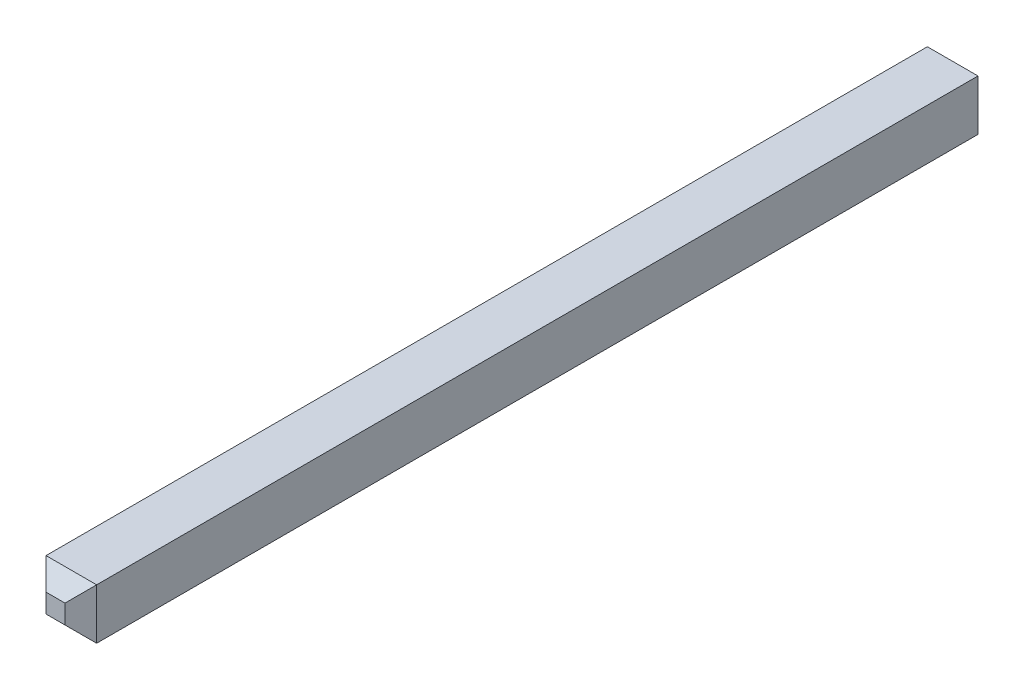
ISO-10303-21;
HEADER;
FILE_DESCRIPTION(('STEP AP214'),'2;1');
FILE_NAME('part.step','',(''),(''),'','','');
FILE_SCHEMA(('AUTOMOTIVE_DESIGN { 1 0 10303 214 1 1 1 1 }'));
ENDSEC;
DATA;
#1=APPLICATION_CONTEXT('core data for automotive mechanical design processes');
#2=APPLICATION_PROTOCOL_DEFINITION('international standard','automotive_design',2000,#1);
#3=PRODUCT_CONTEXT('',#1,'mechanical');
#4=PRODUCT('Part','Part','',(#3));
#5=PRODUCT_RELATED_PRODUCT_CATEGORY('part','',(#4));
#6=PRODUCT_DEFINITION_FORMATION('','',#4);
#7=PRODUCT_DEFINITION_CONTEXT('part definition',#1,'design');
#8=PRODUCT_DEFINITION('design','',#6,#7);
#9=PRODUCT_DEFINITION_SHAPE('','',#8);
#10=(LENGTH_UNIT() NAMED_UNIT(*) SI_UNIT(.MILLI.,.METRE.));
#11=(NAMED_UNIT(*) PLANE_ANGLE_UNIT() SI_UNIT($,.RADIAN.));
#12=(NAMED_UNIT(*) SI_UNIT($,.STERADIAN.) SOLID_ANGLE_UNIT());
#13=UNCERTAINTY_MEASURE_WITH_UNIT(LENGTH_MEASURE(1.E-05),#10,'distance_accuracy_value','');
#14=(GEOMETRIC_REPRESENTATION_CONTEXT(3) GLOBAL_UNCERTAINTY_ASSIGNED_CONTEXT((#13)) GLOBAL_UNIT_ASSIGNED_CONTEXT((#10,
#11,#12)) REPRESENTATION_CONTEXT('',''));
#15=CARTESIAN_POINT('',(0.,0.,0.));
#16=DIRECTION('',(0.,0.,1.));
#17=DIRECTION('',(1.,0.,0.));
#18=AXIS2_PLACEMENT_3D('',#15,#16,#17);
#19=CARTESIAN_POINT('',(0.32384,0.12,-5.77));
#20=DIRECTION('',(0.,0.707106781186567,-0.707106781186528));
#21=DIRECTION('',(-1.,0.,0.));
#22=AXIS2_PLACEMENT_3D('',#19,#20,#21);
#23=PLANE('',#22);
#24=DIRECTION('',(0.57735026918962,-0.577350269189635,-0.577350269189622));
#25=VECTOR('',#24,1.);
#26=CARTESIAN_POINT('',(-0.31999999999999,0.320000000000007,-5.57));
#27=LINE('',#26,#25);
#28=CARTESIAN_POINT('',(-0.31999999999999,0.320000000000004,-5.57));
#29=VERTEX_POINT('',#28);
#30=CARTESIAN_POINT('',(-0.11999999999999,0.120000000000001,-5.77));
#31=VERTEX_POINT('',#30);
#32=EDGE_CURVE('E20',#29,#31,#27,.T.);
#33=ORIENTED_EDGE('',*,*,#32,.F.);
#34=DIRECTION('',(-1.,0.,0.));
#35=VECTOR('',#34,1.);
#36=CARTESIAN_POINT('',(0.,0.32,-5.57));
#37=LINE('',#36,#35);
#38=CARTESIAN_POINT('',(0.32,0.32,-5.57));
#39=VERTEX_POINT('',#38);
#40=EDGE_CURVE('E78',#39,#29,#37,.T.);
#41=ORIENTED_EDGE('',*,*,#40,.F.);
#42=DIRECTION('',(0.577350269189627,0.577350269189623,0.577350269189628));
#43=VECTOR('',#42,1.);
#44=CARTESIAN_POINT('',(0.12,0.120000000000002,-5.77));
#45=LINE('',#44,#43);
#46=CARTESIAN_POINT('',(0.12,0.120000000000001,-5.77));
#47=VERTEX_POINT('',#46);
#48=EDGE_CURVE('E115',#47,#39,#45,.T.);
#49=ORIENTED_EDGE('',*,*,#48,.F.);
#50=DIRECTION('',(1.,0.,0.));
#51=VECTOR('',#50,1.);
#52=CARTESIAN_POINT('',(0.,0.12,-5.77));
#53=LINE('',#52,#51);
#54=EDGE_CURVE('E81',#31,#47,#53,.T.);
#55=ORIENTED_EDGE('',*,*,#54,.F.);
#56=EDGE_LOOP('',(#33,#41,#49,#55));
#57=FACE_BOUND('',#56,.T.);
#58=ADVANCED_FACE('F16',(#57),#23,.T.);
#59=CARTESIAN_POINT('',(-0.11999999999999,0.32384,-5.77));
#60=DIRECTION('',(-0.707106781186548,0.,-0.707106781186547));
#61=DIRECTION('',(0.,-1.,0.));
#62=AXIS2_PLACEMENT_3D('',#59,#60,#61);
#63=PLANE('',#62);
#64=DIRECTION('',(0.577350269189617,0.57735026918963,-0.577350269189631));
#65=VECTOR('',#64,1.);
#66=CARTESIAN_POINT('',(-0.319999999999991,-0.32,-5.57));
#67=LINE('',#66,#65);
#68=CARTESIAN_POINT('',(-0.319999999999995,-0.32,-5.57));
#69=VERTEX_POINT('',#68);
#70=CARTESIAN_POINT('',(-0.119999999999993,-0.12,-5.77));
#71=VERTEX_POINT('',#70);
#72=EDGE_CURVE('E103',#69,#71,#67,.T.);
#73=ORIENTED_EDGE('',*,*,#72,.F.);
#74=DIRECTION('',(0.,-1.,0.));
#75=VECTOR('',#74,1.);
#76=CARTESIAN_POINT('',(-0.31999999999999,0.,-5.57));
#77=LINE('',#76,#75);
#78=EDGE_CURVE('E100',#29,#69,#77,.T.);
#79=ORIENTED_EDGE('',*,*,#78,.F.);
#80=ORIENTED_EDGE('',*,*,#32,.T.);
#81=DIRECTION('',(0.,1.,0.));
#82=VECTOR('',#81,1.);
#83=CARTESIAN_POINT('',(-0.11999999999999,0.,-5.77));
#84=LINE('',#83,#82);
#85=EDGE_CURVE('E85',#71,#31,#84,.T.);
#86=ORIENTED_EDGE('',*,*,#85,.F.);
#87=EDGE_LOOP('',(#73,#79,#80,#86));
#88=FACE_BOUND('',#87,.T.);
#89=ADVANCED_FACE('F101',(#88),#63,.T.);
#90=CARTESIAN_POINT('',(0.12,-0.12,-5.77));
#91=DIRECTION('',(0.,0.,-1.));
#92=DIRECTION('',(-1.,0.,0.));
#93=AXIS2_PLACEMENT_3D('',#90,#91,#92);
#94=PLANE('',#93);
#95=ORIENTED_EDGE('',*,*,#85,.T.);
#96=ORIENTED_EDGE('',*,*,#54,.T.);
#97=DIRECTION('',(0.,1.,0.));
#98=VECTOR('',#97,1.);
#99=CARTESIAN_POINT('',(0.12,0.,-5.77));
#100=LINE('',#99,#98);
#101=CARTESIAN_POINT('',(0.119999999999999,-0.12,-5.77));
#102=VERTEX_POINT('',#101);
#103=EDGE_CURVE('E97',#102,#47,#100,.T.);
#104=ORIENTED_EDGE('',*,*,#103,.F.);
#105=DIRECTION('',(1.,0.,0.));
#106=VECTOR('',#105,1.);
#107=CARTESIAN_POINT('',(0.,-0.12,-5.77));
#108=LINE('',#107,#106);
#109=EDGE_CURVE('E124',#71,#102,#108,.T.);
#110=ORIENTED_EDGE('',*,*,#109,.F.);
#111=EDGE_LOOP('',(#95,#96,#104,#110));
#112=FACE_BOUND('',#111,.T.);
#113=ADVANCED_FACE('F165',(#112),#94,.T.);
#114=CARTESIAN_POINT('',(0.32,0.32384,-5.57));
#115=DIRECTION('',(0.707106781186548,0.,-0.707106781186547));
#116=DIRECTION('',(0.,-1.,0.));
#117=AXIS2_PLACEMENT_3D('',#114,#115,#116);
#118=PLANE('',#117);
#119=DIRECTION('',(0.577350269189629,-0.577350269189623,0.577350269189625));
#120=VECTOR('',#119,1.);
#121=CARTESIAN_POINT('',(0.119999999999998,-0.12,-5.77));
#122=LINE('',#121,#120);
#123=CARTESIAN_POINT('',(0.32,-0.32,-5.57));
#124=VERTEX_POINT('',#123);
#125=EDGE_CURVE('E123',#102,#124,#122,.T.);
#126=ORIENTED_EDGE('',*,*,#125,.F.);
#127=ORIENTED_EDGE('',*,*,#103,.T.);
#128=ORIENTED_EDGE('',*,*,#48,.T.);
#129=DIRECTION('',(0.,1.,0.));
#130=VECTOR('',#129,1.);
#131=CARTESIAN_POINT('',(0.32,0.,-5.57));
#132=LINE('',#131,#130);
#133=EDGE_CURVE('E121',#124,#39,#132,.T.);
#134=ORIENTED_EDGE('',*,*,#133,.F.);
#135=EDGE_LOOP('',(#126,#127,#128,#134));
#136=FACE_BOUND('',#135,.T.);
#137=ADVANCED_FACE('F163',(#136),#118,.T.);
#138=CARTESIAN_POINT('',(-0.32,0.32,-5.57));
#139=DIRECTION('',(0.,1.,0.));
#140=DIRECTION('',(0.,0.,1.));
#141=AXIS2_PLACEMENT_3D('',#138,#139,#140);
#142=PLANE('',#141);
#143=DIRECTION('',(0.,0.,-1.));
#144=VECTOR('',#143,1.);
#145=CARTESIAN_POINT('',(-0.31999999999999,0.32,0.));
#146=LINE('',#145,#144);
#147=CARTESIAN_POINT('',(-0.31999999999999,0.32,5.57));
#148=VERTEX_POINT('',#147);
#149=EDGE_CURVE('E91',#148,#29,#146,.T.);
#150=ORIENTED_EDGE('',*,*,#149,.F.);
#151=DIRECTION('',(1.,0.,0.));
#152=VECTOR('',#151,1.);
#153=CARTESIAN_POINT('',(0.,0.32,5.57));
#154=LINE('',#153,#152);
#155=CARTESIAN_POINT('',(0.32,0.32,5.57));
#156=VERTEX_POINT('',#155);
#157=EDGE_CURVE('E96',#148,#156,#154,.T.);
#158=ORIENTED_EDGE('',*,*,#157,.T.);
#159=DIRECTION('',(0.,0.,1.));
#160=VECTOR('',#159,1.);
#161=CARTESIAN_POINT('',(0.32,0.32,0.));
#162=LINE('',#161,#160);
#163=EDGE_CURVE('E94',#39,#156,#162,.T.);
#164=ORIENTED_EDGE('',*,*,#163,.F.);
#165=ORIENTED_EDGE('',*,*,#40,.T.);
#166=EDGE_LOOP('',(#150,#158,#164,#165));
#167=FACE_BOUND('',#166,.T.);
#168=ADVANCED_FACE('F89',(#167),#142,.T.);
#169=CARTESIAN_POINT('',(-0.31999999999999,-0.32,-5.57));
#170=DIRECTION('',(-1.,0.,0.));
#171=DIRECTION('',(0.,0.,1.));
#172=AXIS2_PLACEMENT_3D('',#169,#170,#171);
#173=PLANE('',#172);
#174=DIRECTION('',(0.,0.,-1.));
#175=VECTOR('',#174,1.);
#176=CARTESIAN_POINT('',(-0.32,-0.32,0.));
#177=LINE('',#176,#175);
#178=CARTESIAN_POINT('',(-0.319999999999995,-0.32,5.57));
#179=VERTEX_POINT('',#178);
#180=EDGE_CURVE('E134',#179,#69,#177,.T.);
#181=ORIENTED_EDGE('',*,*,#180,.F.);
#182=DIRECTION('',(0.,1.,0.));
#183=VECTOR('',#182,1.);
#184=CARTESIAN_POINT('',(-0.31999999999999,0.,5.57));
#185=LINE('',#184,#183);
#186=EDGE_CURVE('E107',#179,#148,#185,.T.);
#187=ORIENTED_EDGE('',*,*,#186,.T.);
#188=ORIENTED_EDGE('',*,*,#149,.T.);
#189=ORIENTED_EDGE('',*,*,#78,.T.);
#190=EDGE_LOOP('',(#181,#187,#188,#189));
#191=FACE_BOUND('',#190,.T.);
#192=ADVANCED_FACE('F110',(#191),#173,.T.);
#193=CARTESIAN_POINT('',(0.32384,-0.32,-5.57));
#194=DIRECTION('',(0.,-0.707106781186548,-0.707106781186547));
#195=DIRECTION('',(-1.,0.,0.));
#196=AXIS2_PLACEMENT_3D('',#193,#194,#195);
#197=PLANE('',#196);
#198=ORIENTED_EDGE('',*,*,#125,.T.);
#199=DIRECTION('',(1.,0.,0.));
#200=VECTOR('',#199,1.);
#201=CARTESIAN_POINT('',(0.,-0.32,-5.57));
#202=LINE('',#201,#200);
#203=EDGE_CURVE('E131',#69,#124,#202,.T.);
#204=ORIENTED_EDGE('',*,*,#203,.F.);
#205=ORIENTED_EDGE('',*,*,#72,.T.);
#206=ORIENTED_EDGE('',*,*,#109,.T.);
#207=EDGE_LOOP('',(#198,#204,#205,#206));
#208=FACE_BOUND('',#207,.T.);
#209=ADVANCED_FACE('F168',(#208),#197,.T.);
#210=CARTESIAN_POINT('',(0.32,-0.32,5.57));
#211=DIRECTION('',(1.,0.,0.));
#212=DIRECTION('',(0.,0.,-1.));
#213=AXIS2_PLACEMENT_3D('',#210,#211,#212);
#214=PLANE('',#213);
#215=ORIENTED_EDGE('',*,*,#163,.T.);
#216=DIRECTION('',(0.,-1.,0.));
#217=VECTOR('',#216,1.);
#218=CARTESIAN_POINT('',(0.32,0.,5.57));
#219=LINE('',#218,#217);
#220=CARTESIAN_POINT('',(0.319999999999997,-0.32,5.57));
#221=VERTEX_POINT('',#220);
#222=EDGE_CURVE('E120',#156,#221,#219,.T.);
#223=ORIENTED_EDGE('',*,*,#222,.T.);
#224=DIRECTION('',(0.,0.,1.));
#225=VECTOR('',#224,1.);
#226=CARTESIAN_POINT('',(0.32,-0.32,0.));
#227=LINE('',#226,#225);
#228=EDGE_CURVE('E127',#124,#221,#227,.T.);
#229=ORIENTED_EDGE('',*,*,#228,.F.);
#230=ORIENTED_EDGE('',*,*,#133,.T.);
#231=EDGE_LOOP('',(#215,#223,#229,#230));
#232=FACE_BOUND('',#231,.T.);
#233=ADVANCED_FACE('F186',(#232),#214,.T.);
#234=CARTESIAN_POINT('',(-0.32,-0.32,5.57));
#235=DIRECTION('',(0.,-1.,0.));
#236=DIRECTION('',(0.,0.,-1.));
#237=AXIS2_PLACEMENT_3D('',#234,#235,#236);
#238=PLANE('',#237);
#239=ORIENTED_EDGE('',*,*,#228,.T.);
#240=DIRECTION('',(1.,0.,0.));
#241=VECTOR('',#240,1.);
#242=CARTESIAN_POINT('',(0.,-0.32,5.57));
#243=LINE('',#242,#241);
#244=EDGE_CURVE('E149',#179,#221,#243,.T.);
#245=ORIENTED_EDGE('',*,*,#244,.F.);
#246=ORIENTED_EDGE('',*,*,#180,.T.);
#247=ORIENTED_EDGE('',*,*,#203,.T.);
#248=EDGE_LOOP('',(#239,#245,#246,#247));
#249=FACE_BOUND('',#248,.T.);
#250=ADVANCED_FACE('F172',(#249),#238,.T.);
#251=CARTESIAN_POINT('',(0.12,0.32384,5.77));
#252=DIRECTION('',(0.707106781186548,0.,0.707106781186547));
#253=DIRECTION('',(0.,-1.,0.));
#254=AXIS2_PLACEMENT_3D('',#251,#252,#253);
#255=PLANE('',#254);
#256=DIRECTION('',(0.577350269189629,0.577350269189623,-0.577350269189625));
#257=VECTOR('',#256,1.);
#258=CARTESIAN_POINT('',(0.119999999999998,0.12,5.77));
#259=LINE('',#258,#257);
#260=CARTESIAN_POINT('',(0.119999999999999,0.12,5.77));
#261=VERTEX_POINT('',#260);
#262=EDGE_CURVE('E130',#261,#156,#259,.T.);
#263=ORIENTED_EDGE('',*,*,#262,.F.);
#264=DIRECTION('',(0.,1.,0.));
#265=VECTOR('',#264,1.);
#266=CARTESIAN_POINT('',(0.12,0.,5.77));
#267=LINE('',#266,#265);
#268=CARTESIAN_POINT('',(0.119999999999999,-0.12,5.77));
#269=VERTEX_POINT('',#268);
#270=EDGE_CURVE('E140',#269,#261,#267,.T.);
#271=ORIENTED_EDGE('',*,*,#270,.F.);
#272=DIRECTION('',(-0.577350269189617,0.57735026918963,0.577350269189631));
#273=VECTOR('',#272,1.);
#274=CARTESIAN_POINT('',(0.319999999999994,-0.32,5.57));
#275=LINE('',#274,#273);
#276=EDGE_CURVE('E142',#221,#269,#275,.T.);
#277=ORIENTED_EDGE('',*,*,#276,.F.);
#278=ORIENTED_EDGE('',*,*,#222,.F.);
#279=EDGE_LOOP('',(#263,#271,#277,#278));
#280=FACE_BOUND('',#279,.T.);
#281=ADVANCED_FACE('F183',(#280),#255,.T.);
#282=CARTESIAN_POINT('',(-0.32383999999999,0.12,5.77));
#283=DIRECTION('',(0.,0.707106781186548,0.707106781186547));
#284=DIRECTION('',(1.,0.,0.));
#285=AXIS2_PLACEMENT_3D('',#282,#283,#284);
#286=PLANE('',#285);
#287=DIRECTION('',(-0.577350269189627,0.577350269189623,-0.577350269189628));
#288=VECTOR('',#287,1.);
#289=CARTESIAN_POINT('',(-0.11999999999999,0.120000000000002,5.77));
#290=LINE('',#289,#288);
#291=CARTESIAN_POINT('',(-0.11999999999999,0.120000000000001,5.77));
#292=VERTEX_POINT('',#291);
#293=EDGE_CURVE('E155',#292,#148,#290,.T.);
#294=ORIENTED_EDGE('',*,*,#293,.F.);
#295=DIRECTION('',(-1.,0.,0.));
#296=VECTOR('',#295,1.);
#297=CARTESIAN_POINT('',(0.,0.12,5.77));
#298=LINE('',#297,#296);
#299=EDGE_CURVE('E137',#261,#292,#298,.T.);
#300=ORIENTED_EDGE('',*,*,#299,.F.);
#301=ORIENTED_EDGE('',*,*,#262,.T.);
#302=ORIENTED_EDGE('',*,*,#157,.F.);
#303=EDGE_LOOP('',(#294,#300,#301,#302));
#304=FACE_BOUND('',#303,.T.);
#305=ADVANCED_FACE('F180',(#304),#286,.T.);
#306=CARTESIAN_POINT('',(-0.31999999999999,0.32384,5.57));
#307=DIRECTION('',(-0.707106781186548,0.,0.707106781186547));
#308=DIRECTION('',(0.,-1.,0.));
#309=AXIS2_PLACEMENT_3D('',#306,#307,#308);
#310=PLANE('',#309);
#311=ORIENTED_EDGE('',*,*,#293,.T.);
#312=ORIENTED_EDGE('',*,*,#186,.F.);
#313=DIRECTION('',(-0.577350269189629,-0.577350269189623,-0.577350269189625));
#314=VECTOR('',#313,1.);
#315=CARTESIAN_POINT('',(-0.119999999999988,-0.12,5.77));
#316=LINE('',#315,#314);
#317=CARTESIAN_POINT('',(-0.119999999999989,-0.12,5.77));
#318=VERTEX_POINT('',#317);
#319=EDGE_CURVE('E35',#318,#179,#316,.T.);
#320=ORIENTED_EDGE('',*,*,#319,.F.);
#321=DIRECTION('',(0.,-1.,0.));
#322=VECTOR('',#321,1.);
#323=CARTESIAN_POINT('',(-0.11999999999999,0.,5.77));
#324=LINE('',#323,#322);
#325=EDGE_CURVE('E26',#292,#318,#324,.T.);
#326=ORIENTED_EDGE('',*,*,#325,.F.);
#327=EDGE_LOOP('',(#311,#312,#320,#326));
#328=FACE_BOUND('',#327,.T.);
#329=ADVANCED_FACE('F178',(#328),#310,.T.);
#330=CARTESIAN_POINT('',(-0.32383999999999,-0.32,5.57));
#331=DIRECTION('',(0.,-0.707106781186548,0.707106781186547));
#332=DIRECTION('',(1.,0.,0.));
#333=AXIS2_PLACEMENT_3D('',#330,#331,#332);
#334=PLANE('',#333);
#335=ORIENTED_EDGE('',*,*,#276,.T.);
#336=DIRECTION('',(1.,0.,0.));
#337=VECTOR('',#336,1.);
#338=CARTESIAN_POINT('',(0.,-0.12,5.77));
#339=LINE('',#338,#337);
#340=EDGE_CURVE('E11',#318,#269,#339,.T.);
#341=ORIENTED_EDGE('',*,*,#340,.F.);
#342=ORIENTED_EDGE('',*,*,#319,.T.);
#343=ORIENTED_EDGE('',*,*,#244,.T.);
#344=EDGE_LOOP('',(#335,#341,#342,#343));
#345=FACE_BOUND('',#344,.T.);
#346=ADVANCED_FACE('F175',(#345),#334,.T.);
#347=CARTESIAN_POINT('',(-0.11999999999999,-0.12,5.77));
#348=DIRECTION('',(0.,0.,1.));
#349=DIRECTION('',(1.,0.,0.));
#350=AXIS2_PLACEMENT_3D('',#347,#348,#349);
#351=PLANE('',#350);
#352=ORIENTED_EDGE('',*,*,#325,.T.);
#353=ORIENTED_EDGE('',*,*,#340,.T.);
#354=ORIENTED_EDGE('',*,*,#270,.T.);
#355=ORIENTED_EDGE('',*,*,#299,.T.);
#356=EDGE_LOOP('',(#352,#353,#354,#355));
#357=FACE_BOUND('',#356,.T.);
#358=ADVANCED_FACE('F18',(#357),#351,.T.);
#359=CLOSED_SHELL('',(#58,#89,#113,#137,#168,#192,#209,#233,#250,#281,#305,#329,#346,#358));
#360=MANIFOLD_SOLID_BREP('B1',#359);
#361=ADVANCED_BREP_SHAPE_REPRESENTATION('',(#18,#360),#14);
#362=SHAPE_DEFINITION_REPRESENTATION(#9,#361);
ENDSEC;
END-ISO-10303-21;
